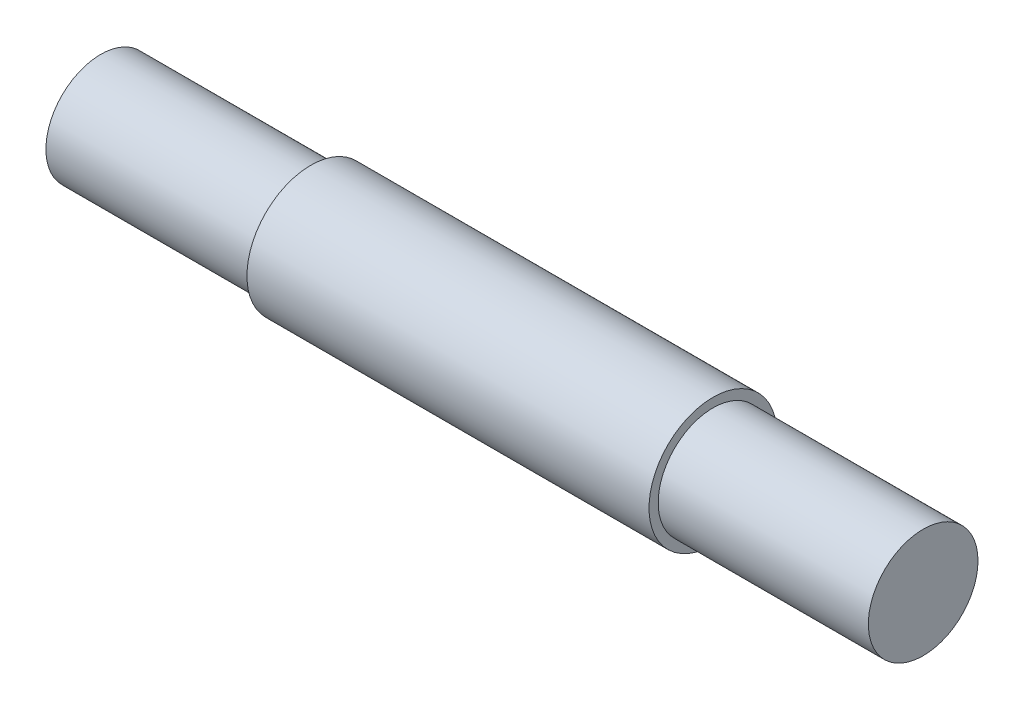
ISO-10303-21;
HEADER;
FILE_DESCRIPTION(('STEP AP214'),'2;1');
FILE_NAME('part.step','',(''),(''),'','','');
FILE_SCHEMA(('AUTOMOTIVE_DESIGN { 1 0 10303 214 1 1 1 1 }'));
ENDSEC;
DATA;
#1=APPLICATION_CONTEXT('core data for automotive mechanical design processes');
#2=APPLICATION_PROTOCOL_DEFINITION('international standard','automotive_design',2000,#1);
#3=PRODUCT_CONTEXT('',#1,'mechanical');
#4=PRODUCT('Part','Part','',(#3));
#5=PRODUCT_RELATED_PRODUCT_CATEGORY('part','',(#4));
#6=PRODUCT_DEFINITION_FORMATION('','',#4);
#7=PRODUCT_DEFINITION_CONTEXT('part definition',#1,'design');
#8=PRODUCT_DEFINITION('design','',#6,#7);
#9=PRODUCT_DEFINITION_SHAPE('','',#8);
#10=(LENGTH_UNIT() NAMED_UNIT(*) SI_UNIT(.MILLI.,.METRE.));
#11=(NAMED_UNIT(*) PLANE_ANGLE_UNIT() SI_UNIT($,.RADIAN.));
#12=(NAMED_UNIT(*) SI_UNIT($,.STERADIAN.) SOLID_ANGLE_UNIT());
#13=UNCERTAINTY_MEASURE_WITH_UNIT(LENGTH_MEASURE(1.E-05),#10,'distance_accuracy_value','');
#14=(GEOMETRIC_REPRESENTATION_CONTEXT(3) GLOBAL_UNCERTAINTY_ASSIGNED_CONTEXT((#13)) GLOBAL_UNIT_ASSIGNED_CONTEXT((#10,
#11,#12)) REPRESENTATION_CONTEXT('',''));
#15=CARTESIAN_POINT('',(0.,0.,0.));
#16=DIRECTION('',(0.,0.,1.));
#17=DIRECTION('',(1.,0.,0.));
#18=AXIS2_PLACEMENT_3D('',#15,#16,#17);
#19=CARTESIAN_POINT('',(28.575,0.,0.));
#20=DIRECTION('',(-1.,0.,0.));
#21=DIRECTION('',(0.,0.,1.));
#22=AXIS2_PLACEMENT_3D('',#19,#20,#21);
#23=CYLINDRICAL_SURFACE('',#22,4.445);
#24=CARTESIAN_POINT('',(-13.97,0.,0.));
#25=DIRECTION('',(1.,0.,0.));
#26=DIRECTION('',(0.,0.,-1.));
#27=AXIS2_PLACEMENT_3D('',#24,#25,#26);
#28=CIRCLE('',#27,4.445);
#29=CARTESIAN_POINT('',(-13.97,0.,-4.445));
#30=VERTEX_POINT('',#29);
#31=EDGE_CURVE('E47',#30,#30,#28,.T.);
#32=ORIENTED_EDGE('',*,*,#31,.T.);
#33=EDGE_LOOP('',(#32));
#34=FACE_BOUND('',#33,.T.);
#35=CARTESIAN_POINT('',(13.97,0.,0.));
#36=DIRECTION('',(1.,0.,0.));
#37=DIRECTION('',(0.,0.,-1.));
#38=AXIS2_PLACEMENT_3D('',#35,#36,#37);
#39=CIRCLE('',#38,4.445);
#40=CARTESIAN_POINT('',(13.97,0.,-4.445));
#41=VERTEX_POINT('',#40);
#42=EDGE_CURVE('E11',#41,#41,#39,.T.);
#43=ORIENTED_EDGE('',*,*,#42,.F.);
#44=EDGE_LOOP('',(#43));
#45=FACE_BOUND('',#44,.T.);
#46=ADVANCED_FACE('F44',(#34,#45),#23,.T.);
#47=CARTESIAN_POINT('',(13.97,0.,0.));
#48=DIRECTION('',(1.,0.,0.));
#49=DIRECTION('',(0.,0.,-1.));
#50=AXIS2_PLACEMENT_3D('',#47,#48,#49);
#51=PLANE('',#50);
#52=CARTESIAN_POINT('',(13.97,0.,0.));
#53=DIRECTION('',(1.,0.,0.));
#54=DIRECTION('',(0.,0.,-1.));
#55=AXIS2_PLACEMENT_3D('',#52,#53,#54);
#56=CIRCLE('',#55,3.81);
#57=CARTESIAN_POINT('',(13.97,0.,-3.81));
#58=VERTEX_POINT('',#57);
#59=EDGE_CURVE('E51',#58,#58,#56,.T.);
#60=ORIENTED_EDGE('',*,*,#59,.F.);
#61=EDGE_LOOP('',(#60));
#62=FACE_BOUND('',#61,.T.);
#63=ORIENTED_EDGE('',*,*,#42,.T.);
#64=EDGE_LOOP('',(#63));
#65=FACE_BOUND('',#64,.T.);
#66=ADVANCED_FACE('F89',(#62,#65),#51,.T.);
#67=CARTESIAN_POINT('',(13.97,0.,0.));
#68=DIRECTION('',(1.,0.,0.));
#69=DIRECTION('',(0.,0.,-1.));
#70=AXIS2_PLACEMENT_3D('',#67,#68,#69);
#71=CYLINDRICAL_SURFACE('',#70,3.81);
#72=ORIENTED_EDGE('',*,*,#59,.T.);
#73=EDGE_LOOP('',(#72));
#74=FACE_BOUND('',#73,.T.);
#75=CARTESIAN_POINT('',(28.575,0.,0.));
#76=DIRECTION('',(1.,0.,0.));
#77=DIRECTION('',(0.,0.,-1.));
#78=AXIS2_PLACEMENT_3D('',#75,#76,#77);
#79=CIRCLE('',#78,3.81);
#80=CARTESIAN_POINT('',(28.575,0.,-3.81));
#81=VERTEX_POINT('',#80);
#82=EDGE_CURVE('E55',#81,#81,#79,.T.);
#83=ORIENTED_EDGE('',*,*,#82,.F.);
#84=EDGE_LOOP('',(#83));
#85=FACE_BOUND('',#84,.T.);
#86=ADVANCED_FACE('F84',(#74,#85),#71,.T.);
#87=CARTESIAN_POINT('',(28.575,0.,0.));
#88=DIRECTION('',(1.,0.,0.));
#89=DIRECTION('',(0.,0.,-1.));
#90=AXIS2_PLACEMENT_3D('',#87,#88,#89);
#91=PLANE('',#90);
#92=ORIENTED_EDGE('',*,*,#82,.T.);
#93=EDGE_LOOP('',(#92));
#94=FACE_BOUND('',#93,.T.);
#95=ADVANCED_FACE('F75',(#94),#91,.T.);
#96=CARTESIAN_POINT('',(-13.97,0.,0.));
#97=DIRECTION('',(1.,0.,0.));
#98=DIRECTION('',(0.,0.,-1.));
#99=AXIS2_PLACEMENT_3D('',#96,#97,#98);
#100=PLANE('',#99);
#101=CARTESIAN_POINT('',(-13.97,0.,0.));
#102=DIRECTION('',(1.,0.,0.));
#103=DIRECTION('',(0.,0.,-1.));
#104=AXIS2_PLACEMENT_3D('',#101,#102,#103);
#105=CIRCLE('',#104,3.81);
#106=CARTESIAN_POINT('',(-13.97,0.,-3.81));
#107=VERTEX_POINT('',#106);
#108=EDGE_CURVE('E63',#107,#107,#105,.T.);
#109=ORIENTED_EDGE('',*,*,#108,.T.);
#110=EDGE_LOOP('',(#109));
#111=FACE_BOUND('',#110,.T.);
#112=ORIENTED_EDGE('',*,*,#31,.F.);
#113=EDGE_LOOP('',(#112));
#114=FACE_BOUND('',#113,.T.);
#115=ADVANCED_FACE('F72',(#111,#114),#100,.F.);
#116=CARTESIAN_POINT('',(-13.97,0.,0.));
#117=DIRECTION('',(-1.,0.,0.));
#118=DIRECTION('',(0.,0.,1.));
#119=AXIS2_PLACEMENT_3D('',#116,#117,#118);
#120=CYLINDRICAL_SURFACE('',#119,3.81);
#121=ORIENTED_EDGE('',*,*,#108,.F.);
#122=EDGE_LOOP('',(#121));
#123=FACE_BOUND('',#122,.T.);
#124=CARTESIAN_POINT('',(-28.575,0.,0.));
#125=DIRECTION('',(1.,0.,0.));
#126=DIRECTION('',(0.,0.,-1.));
#127=AXIS2_PLACEMENT_3D('',#124,#125,#126);
#128=CIRCLE('',#127,3.81);
#129=CARTESIAN_POINT('',(-28.575,0.,-3.81));
#130=VERTEX_POINT('',#129);
#131=EDGE_CURVE('E60',#130,#130,#128,.T.);
#132=ORIENTED_EDGE('',*,*,#131,.T.);
#133=EDGE_LOOP('',(#132));
#134=FACE_BOUND('',#133,.T.);
#135=ADVANCED_FACE('F74',(#123,#134),#120,.T.);
#136=CARTESIAN_POINT('',(-28.575,0.,0.));
#137=DIRECTION('',(1.,0.,0.));
#138=DIRECTION('',(0.,0.,-1.));
#139=AXIS2_PLACEMENT_3D('',#136,#137,#138);
#140=PLANE('',#139);
#141=ORIENTED_EDGE('',*,*,#131,.F.);
#142=EDGE_LOOP('',(#141));
#143=FACE_BOUND('',#142,.T.);
#144=ADVANCED_FACE('F81',(#143),#140,.F.);
#145=CLOSED_SHELL('',(#46,#66,#86,#95,#115,#135,#144));
#146=MANIFOLD_SOLID_BREP('B2',#145);
#147=ADVANCED_BREP_SHAPE_REPRESENTATION('',(#18,#146),#14);
#148=SHAPE_DEFINITION_REPRESENTATION(#9,#147);
ENDSEC;
END-ISO-10303-21;
